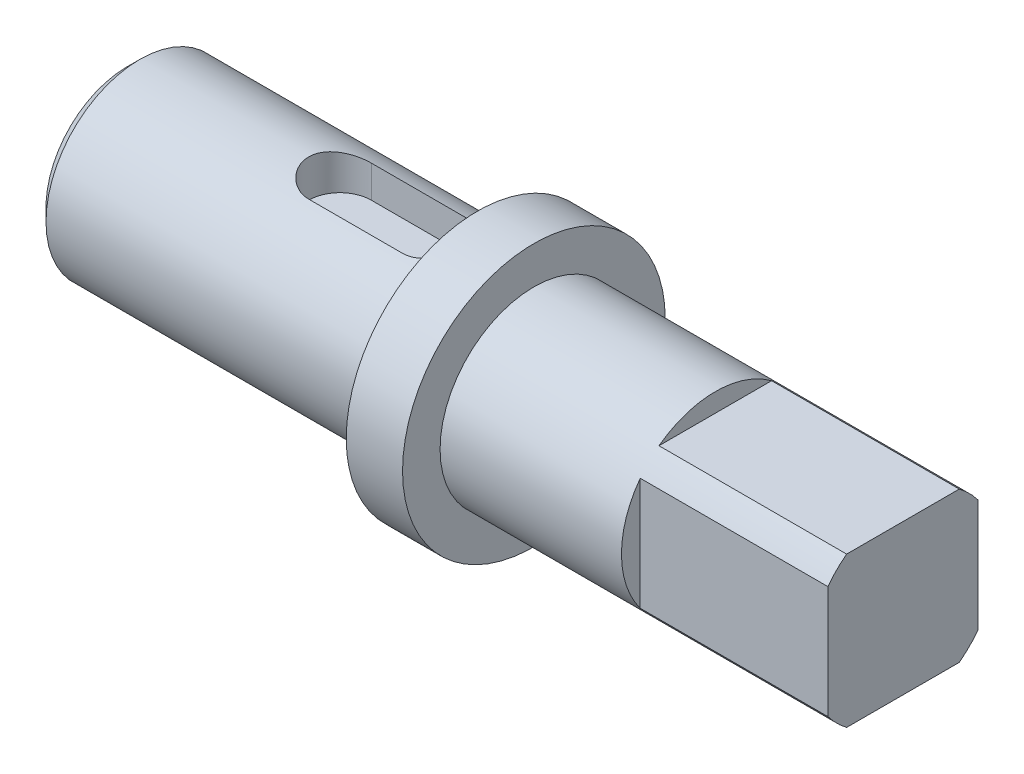
ISO-10303-21;
HEADER;
FILE_DESCRIPTION(('STEP AP214'),'2;1');
FILE_NAME('part.step','',(''),(''),'','','');
FILE_SCHEMA(('AUTOMOTIVE_DESIGN { 1 0 10303 214 1 1 1 1 }'));
ENDSEC;
DATA;
#1=APPLICATION_CONTEXT('core data for automotive mechanical design processes');
#2=APPLICATION_PROTOCOL_DEFINITION('international standard','automotive_design',2000,#1);
#3=PRODUCT_CONTEXT('',#1,'mechanical');
#4=PRODUCT('Part','Part','',(#3));
#5=PRODUCT_RELATED_PRODUCT_CATEGORY('part','',(#4));
#6=PRODUCT_DEFINITION_FORMATION('','',#4);
#7=PRODUCT_DEFINITION_CONTEXT('part definition',#1,'design');
#8=PRODUCT_DEFINITION('design','',#6,#7);
#9=PRODUCT_DEFINITION_SHAPE('','',#8);
#10=(LENGTH_UNIT() NAMED_UNIT(*) SI_UNIT(.MILLI.,.METRE.));
#11=(NAMED_UNIT(*) PLANE_ANGLE_UNIT() SI_UNIT($,.RADIAN.));
#12=(NAMED_UNIT(*) SI_UNIT($,.STERADIAN.) SOLID_ANGLE_UNIT());
#13=UNCERTAINTY_MEASURE_WITH_UNIT(LENGTH_MEASURE(1.E-05),#10,'distance_accuracy_value','');
#14=(GEOMETRIC_REPRESENTATION_CONTEXT(3) GLOBAL_UNCERTAINTY_ASSIGNED_CONTEXT((#13)) GLOBAL_UNIT_ASSIGNED_CONTEXT((#10,
#11,#12)) REPRESENTATION_CONTEXT('',''));
#15=CARTESIAN_POINT('',(0.,0.,0.));
#16=DIRECTION('',(0.,0.,1.));
#17=DIRECTION('',(1.,0.,0.));
#18=AXIS2_PLACEMENT_3D('',#15,#16,#17);
#19=CARTESIAN_POINT('',(0.,0.,0.));
#20=DIRECTION('',(-1.,0.,0.));
#21=DIRECTION('',(0.,0.,1.));
#22=AXIS2_PLACEMENT_3D('',#19,#20,#21);
#23=CYLINDRICAL_SURFACE('',#22,7.5);
#24=CARTESIAN_POINT('',(32.5,0.,0.));
#25=DIRECTION('',(-1.,0.,0.));
#26=DIRECTION('',(0.,0.,1.));
#27=AXIS2_PLACEMENT_3D('',#24,#25,#26);
#28=CIRCLE('',#27,7.5);
#29=CARTESIAN_POINT('',(32.5,0.,7.5));
#30=VERTEX_POINT('',#29);
#31=EDGE_CURVE('E134',#30,#30,#28,.T.);
#32=ORIENTED_EDGE('',*,*,#31,.F.);
#33=EDGE_LOOP('',(#32));
#34=FACE_BOUND('',#33,.T.);
#35=DIRECTION('',(-1.,0.,0.));
#36=VECTOR('',#35,1.);
#37=CARTESIAN_POINT('',(0.,-4.5,-6.));
#38=LINE('',#37,#36);
#39=CARTESIAN_POINT('',(62.,-4.5,-6.));
#40=VERTEX_POINT('',#39);
#41=CARTESIAN_POINT('',(47.,-4.5,-6.));
#42=VERTEX_POINT('',#41);
#43=EDGE_CURVE('E394',#40,#42,#38,.T.);
#44=ORIENTED_EDGE('',*,*,#43,.F.);
#45=CARTESIAN_POINT('',(62.,0.,0.));
#46=DIRECTION('',(-1.,0.,0.));
#47=DIRECTION('',(0.,0.,1.));
#48=AXIS2_PLACEMENT_3D('',#45,#46,#47);
#49=CIRCLE('',#48,7.5);
#50=CARTESIAN_POINT('',(62.,-6.,-4.5));
#51=VERTEX_POINT('',#50);
#52=EDGE_CURVE('E132',#40,#51,#49,.T.);
#53=ORIENTED_EDGE('',*,*,#52,.T.);
#54=DIRECTION('',(-1.,0.,0.));
#55=VECTOR('',#54,1.);
#56=CARTESIAN_POINT('',(0.,-6.,-4.5));
#57=LINE('',#56,#55);
#58=CARTESIAN_POINT('',(47.,-6.,-4.5));
#59=VERTEX_POINT('',#58);
#60=EDGE_CURVE('E39',#59,#51,#57,.F.);
#61=ORIENTED_EDGE('',*,*,#60,.F.);
#62=CARTESIAN_POINT('',(47.,0.,0.));
#63=DIRECTION('',(1.,0.,0.));
#64=DIRECTION('',(0.,0.,-1.));
#65=AXIS2_PLACEMENT_3D('',#62,#63,#64);
#66=CIRCLE('',#65,7.5);
#67=CARTESIAN_POINT('',(47.,-6.,4.5));
#68=VERTEX_POINT('',#67);
#69=EDGE_CURVE('E24',#68,#59,#66,.T.);
#70=ORIENTED_EDGE('',*,*,#69,.F.);
#71=DIRECTION('',(-1.,0.,0.));
#72=VECTOR('',#71,1.);
#73=CARTESIAN_POINT('',(0.,-6.,4.5));
#74=LINE('',#73,#72);
#75=CARTESIAN_POINT('',(62.,-6.,4.5));
#76=VERTEX_POINT('',#75);
#77=EDGE_CURVE('E403',#76,#68,#74,.T.);
#78=ORIENTED_EDGE('',*,*,#77,.F.);
#79=CARTESIAN_POINT('',(62.,-4.5,6.));
#80=VERTEX_POINT('',#79);
#81=EDGE_CURVE('E135',#76,#80,#49,.T.);
#82=ORIENTED_EDGE('',*,*,#81,.T.);
#83=DIRECTION('',(-1.,0.,0.));
#84=VECTOR('',#83,1.);
#85=CARTESIAN_POINT('',(0.,-4.5,6.));
#86=LINE('',#85,#84);
#87=CARTESIAN_POINT('',(47.,-4.5,6.));
#88=VERTEX_POINT('',#87);
#89=EDGE_CURVE('E31',#88,#80,#86,.F.);
#90=ORIENTED_EDGE('',*,*,#89,.F.);
#91=CARTESIAN_POINT('',(47.,4.5,6.));
#92=VERTEX_POINT('',#91);
#93=EDGE_CURVE('E436',#92,#88,#66,.T.);
#94=ORIENTED_EDGE('',*,*,#93,.F.);
#95=DIRECTION('',(-1.,0.,0.));
#96=VECTOR('',#95,1.);
#97=CARTESIAN_POINT('',(0.,4.5,6.));
#98=LINE('',#97,#96);
#99=CARTESIAN_POINT('',(62.,4.5,6.));
#100=VERTEX_POINT('',#99);
#101=EDGE_CURVE('E445',#100,#92,#98,.T.);
#102=ORIENTED_EDGE('',*,*,#101,.F.);
#103=CARTESIAN_POINT('',(62.,6.,4.5));
#104=VERTEX_POINT('',#103);
#105=EDGE_CURVE('E131',#100,#104,#49,.T.);
#106=ORIENTED_EDGE('',*,*,#105,.T.);
#107=DIRECTION('',(-1.,0.,0.));
#108=VECTOR('',#107,1.);
#109=CARTESIAN_POINT('',(0.,6.,4.5));
#110=LINE('',#109,#108);
#111=CARTESIAN_POINT('',(47.,6.,4.5));
#112=VERTEX_POINT('',#111);
#113=EDGE_CURVE('E112',#112,#104,#110,.F.);
#114=ORIENTED_EDGE('',*,*,#113,.F.);
#115=CARTESIAN_POINT('',(47.,6.,-4.5));
#116=VERTEX_POINT('',#115);
#117=EDGE_CURVE('E19',#116,#112,#66,.T.);
#118=ORIENTED_EDGE('',*,*,#117,.F.);
#119=DIRECTION('',(-1.,0.,0.));
#120=VECTOR('',#119,1.);
#121=CARTESIAN_POINT('',(0.,6.,-4.5));
#122=LINE('',#121,#120);
#123=CARTESIAN_POINT('',(62.,6.,-4.5));
#124=VERTEX_POINT('',#123);
#125=EDGE_CURVE('E109',#124,#116,#122,.T.);
#126=ORIENTED_EDGE('',*,*,#125,.F.);
#127=CARTESIAN_POINT('',(62.,4.5,-6.));
#128=VERTEX_POINT('',#127);
#129=EDGE_CURVE('E125',#124,#128,#49,.T.);
#130=ORIENTED_EDGE('',*,*,#129,.T.);
#131=DIRECTION('',(-1.,0.,0.));
#132=VECTOR('',#131,1.);
#133=CARTESIAN_POINT('',(0.,4.5,-6.));
#134=LINE('',#133,#132);
#135=CARTESIAN_POINT('',(47.,4.5,-6.));
#136=VERTEX_POINT('',#135);
#137=EDGE_CURVE('E399',#136,#128,#134,.F.);
#138=ORIENTED_EDGE('',*,*,#137,.F.);
#139=EDGE_CURVE('E10',#42,#136,#66,.T.);
#140=ORIENTED_EDGE('',*,*,#139,.F.);
#141=EDGE_LOOP('',(#44,#53,#61,#70,#78,#82,#90,#94,#102,#106,#114,#118,#126,#130,#138,#140));
#142=FACE_BOUND('',#141,.T.);
#143=ADVANCED_FACE('F15',(#34,#142),#23,.T.);
#144=CARTESIAN_POINT('',(62.,7.5,0.));
#145=DIRECTION('',(-1.,0.,0.));
#146=DIRECTION('',(0.,0.,1.));
#147=AXIS2_PLACEMENT_3D('',#144,#145,#146);
#148=PLANE('',#147);
#149=DIRECTION('',(0.,-1.,0.));
#150=VECTOR('',#149,1.);
#151=CARTESIAN_POINT('',(62.,7.5,-6.));
#152=LINE('',#151,#150);
#153=EDGE_CURVE('E130',#128,#40,#152,.T.);
#154=ORIENTED_EDGE('',*,*,#153,.F.);
#155=ORIENTED_EDGE('',*,*,#129,.F.);
#156=DIRECTION('',(0.,0.,-1.));
#157=VECTOR('',#156,1.);
#158=CARTESIAN_POINT('',(62.,6.,0.));
#159=LINE('',#158,#157);
#160=EDGE_CURVE('E105',#104,#124,#159,.T.);
#161=ORIENTED_EDGE('',*,*,#160,.F.);
#162=ORIENTED_EDGE('',*,*,#105,.F.);
#163=DIRECTION('',(0.,1.,0.));
#164=VECTOR('',#163,1.);
#165=CARTESIAN_POINT('',(62.,7.5,6.));
#166=LINE('',#165,#164);
#167=EDGE_CURVE('E117',#80,#100,#166,.T.);
#168=ORIENTED_EDGE('',*,*,#167,.F.);
#169=ORIENTED_EDGE('',*,*,#81,.F.);
#170=DIRECTION('',(0.,0.,1.));
#171=VECTOR('',#170,1.);
#172=CARTESIAN_POINT('',(62.,-6.,0.));
#173=LINE('',#172,#171);
#174=EDGE_CURVE('E435',#51,#76,#173,.T.);
#175=ORIENTED_EDGE('',*,*,#174,.F.);
#176=ORIENTED_EDGE('',*,*,#52,.F.);
#177=EDGE_LOOP('',(#154,#155,#161,#162,#168,#169,#175,#176));
#178=FACE_BOUND('',#177,.T.);
#179=ADVANCED_FACE('F128',(#178),#148,.F.);
#180=CARTESIAN_POINT('',(0.,0.,0.));
#181=DIRECTION('',(1.,0.,0.));
#182=DIRECTION('',(0.,0.,-1.));
#183=AXIS2_PLACEMENT_3D('',#180,#181,#182);
#184=PLANE('',#183);
#185=CARTESIAN_POINT('',(0.,0.,0.));
#186=DIRECTION('',(1.,0.,0.));
#187=DIRECTION('',(0.,0.,-1.));
#188=AXIS2_PLACEMENT_3D('',#185,#186,#187);
#189=CIRCLE('',#188,6.5);
#190=CARTESIAN_POINT('',(0.,0.,-6.5));
#191=VERTEX_POINT('',#190);
#192=EDGE_CURVE('E152',#191,#191,#189,.F.);
#193=ORIENTED_EDGE('',*,*,#192,.T.);
#194=EDGE_LOOP('',(#193));
#195=FACE_BOUND('',#194,.T.);
#196=ADVANCED_FACE('F196',(#195),#184,.F.);
#197=CARTESIAN_POINT('',(0.,0.,0.));
#198=DIRECTION('',(-1.,0.,0.));
#199=DIRECTION('',(0.,0.,1.));
#200=AXIS2_PLACEMENT_3D('',#197,#198,#199);
#201=CYLINDRICAL_SURFACE('',#200,7.5);
#202=DIRECTION('',(-1.,0.,0.));
#203=VECTOR('',#202,1.);
#204=CARTESIAN_POINT('',(0.,7.07106781186548,-2.5));
#205=LINE('',#204,#203);
#206=CARTESIAN_POINT('',(17.,7.07106781186548,-2.5));
#207=VERTEX_POINT('',#206);
#208=CARTESIAN_POINT('',(24.5,7.07106781186548,-2.5));
#209=VERTEX_POINT('',#208);
#210=EDGE_CURVE('E118',#207,#209,#205,.F.);
#211=ORIENTED_EDGE('',*,*,#210,.T.);
#212=CARTESIAN_POINT('',(24.5,7.07106781186548,-2.5));
#213=CARTESIAN_POINT('',(24.5682070778203,7.07105693273157,-2.50000899110406));
#214=CARTESIAN_POINT('',(24.6364080746754,7.07205443904569,-2.49720887221585));
#215=CARTESIAN_POINT('',(24.7722810383493,7.07598524121007,-2.4860604578047));
#216=CARTESIAN_POINT('',(24.8399531429881,7.07891801450643,-2.47771365997202));
#217=CARTESIAN_POINT('',(24.9740904883546,7.08662705252507,-2.45557459422795));
#218=CARTESIAN_POINT('',(25.0405587025509,7.09139784850119,-2.44179847763135));
#219=CARTESIAN_POINT('',(25.1720082685828,7.10262619906002,-2.4089418103012));
#220=CARTESIAN_POINT('',(25.2369895665899,7.10908381460331,-2.38986106786032));
#221=CARTESIAN_POINT('',(25.4289615797146,7.13069940793911,-2.32491551306196));
#222=CARTESIAN_POINT('',(25.55317915747,7.14811243884051,-2.2713141681025));
#223=CARTESIAN_POINT('',(25.7908768114634,7.1869703408752,-2.14517784106255));
#224=CARTESIAN_POINT('',(25.9043502357802,7.20841768551076,-2.07263123268531));
#225=CARTESIAN_POINT('',(26.1217929034708,7.25386182389478,-1.90762995846818));
#226=CARTESIAN_POINT('',(26.2252851427682,7.27792189428067,-1.81456284630833));
#227=CARTESIAN_POINT('',(26.4155171032337,7.32534626726038,-1.61247071190513));
#228=CARTESIAN_POINT('',(26.502253841319,7.34871044533518,-1.50344285413658));
#229=CARTESIAN_POINT('',(26.6586982242625,7.39284706096344,-1.26900922493972));
#230=CARTESIAN_POINT('',(26.7279023077422,7.41353593532888,-1.14325025284461));
#231=CARTESIAN_POINT('',(26.8439807824347,7.44924021883279,-0.881073095475287));
#232=CARTESIAN_POINT('',(26.8908619949257,7.46425736081205,-0.744658181225885));
#233=CARTESIAN_POINT('',(26.9593392762583,7.48647677762783,-0.470073371182911));
#234=CARTESIAN_POINT('',(26.9817581709572,7.49393272446142,-0.332129588153743));
#235=CARTESIAN_POINT('',(27.0032907567385,7.50109021034827,-0.0542474216361979));
#236=CARTESIAN_POINT('',(27.0024100009158,7.50079359709905,0.0856904786402172));
#237=CARTESIAN_POINT('',(26.9778892895995,7.49265096581776,0.357759612692404));
#238=CARTESIAN_POINT('',(26.9551434043953,7.48510152476446,0.489981756428174));
#239=CARTESIAN_POINT('',(26.8890170040208,7.46367401253772,0.748610161077312));
#240=CARTESIAN_POINT('',(26.8456353446747,7.4497955904479,0.875016099077735));
#241=CARTESIAN_POINT('',(26.7389465758055,7.41689170677793,1.12038155754035));
#242=CARTESIAN_POINT('',(26.6753848871424,7.39780094595656,1.23922126412504));
#243=CARTESIAN_POINT('',(26.530350121575,7.35645969200235,1.46481147275367));
#244=CARTESIAN_POINT('',(26.4488721723979,7.33420833994017,1.57155867428943));
#245=CARTESIAN_POINT('',(26.265822374993,7.28765679856813,1.77524334927518));
#246=CARTESIAN_POINT('',(26.1634861409717,7.26330946699776,1.87148402903098));
#247=CARTESIAN_POINT('',(25.9438962757136,7.21618726182137,2.04568006205173));
#248=CARTESIAN_POINT('',(25.826637843993,7.19341289789386,2.12362950795974));
#249=CARTESIAN_POINT('',(25.5782995541157,7.15175078440791,2.26000831398175));
#250=CARTESIAN_POINT('',(25.4470412126674,7.13292537370586,2.31813252376915));
#251=CARTESIAN_POINT('',(25.1758825560254,7.10202742655098,2.41115057675284));
#252=CARTESIAN_POINT('',(25.0359962665697,7.08994423522482,2.4460810901384));
#253=CARTESIAN_POINT('',(24.82895340813,7.07841355236799,2.47914539070207));
#254=CARTESIAN_POINT('',(24.7633965253644,7.07566669236504,2.48696265313779));
#255=CARTESIAN_POINT('',(24.6319048040005,7.07199258928497,2.49738654017799));
#256=CARTESIAN_POINT('',(24.565970563639,7.0710629982382,2.49999988848745));
#257=CARTESIAN_POINT('',(24.5,7.07106781186548,2.5));
#258=B_SPLINE_CURVE_WITH_KNOTS('',3,(#212,#213,#214,#215,#216,#217,#218,#219,#220,#221,#222,
#223,#224,#225,#226,#227,#228,#229,#230,#231,#232,#233,#234,#235,#236,#237,#238,#239,#240,#241,
#242,#243,#244,#245,#246,#247,#248,#249,#250,#251,#252,#253,#254,#255,#256,#257),.UNSPECIFIED.,
.F.,.F.,(4,2,2,2,2,2,2,2,2,2,2,2,2,2,2,2,2,2,2,2,2,2,4),(0.,0.204546211838591,0.40903721542367,
0.612924429429088,0.816819012805401,1.22401016923254,1.63145179965521,2.05327864088389,
2.47518051341065,2.90809434014449,3.34087579484514,3.75860278500203,4.17623021758302,
4.57747647846034,4.97874498952316,5.38529148746616,5.79194868153618,6.21771736826822,
6.64362337304801,7.07581676501794,7.50732520398792,7.70536340013574,7.90314555504337),.UNSPECIFIED.);
#259=CARTESIAN_POINT('',(24.5,7.07106781186548,2.5));
#260=VERTEX_POINT('',#259);
#261=EDGE_CURVE('E158',#209,#260,#258,.T.);
#262=ORIENTED_EDGE('',*,*,#261,.T.);
#263=DIRECTION('',(-1.,0.,0.));
#264=VECTOR('',#263,1.);
#265=CARTESIAN_POINT('',(0.,7.07106781186548,2.5));
#266=LINE('',#265,#264);
#267=CARTESIAN_POINT('',(17.,7.07106781186548,2.5));
#268=VERTEX_POINT('',#267);
#269=EDGE_CURVE('E430',#260,#268,#266,.T.);
#270=ORIENTED_EDGE('',*,*,#269,.T.);
#271=CARTESIAN_POINT('',(17.,7.07106781186548,2.5));
#272=CARTESIAN_POINT('',(16.9317929221797,7.07105693273157,2.50000899110406));
#273=CARTESIAN_POINT('',(16.8635919253246,7.07205443904569,2.49720887221585));
#274=CARTESIAN_POINT('',(16.7277189616507,7.07598524121007,2.4860604578047));
#275=CARTESIAN_POINT('',(16.6600468570119,7.07891801450642,2.47771365997202));
#276=CARTESIAN_POINT('',(16.5259095116454,7.08662705252507,2.45557459422795));
#277=CARTESIAN_POINT('',(16.4594412974491,7.09139784850119,2.44179847763135));
#278=CARTESIAN_POINT('',(16.3279917314172,7.10262619906002,2.4089418103012));
#279=CARTESIAN_POINT('',(16.2630104334101,7.10908381460331,2.38986106786032));
#280=CARTESIAN_POINT('',(16.0710384202854,7.13069940793911,2.32491551306196));
#281=CARTESIAN_POINT('',(15.94682084253,7.14811243884051,2.2713141681025));
#282=CARTESIAN_POINT('',(15.7091231885366,7.1869703408752,2.14517784106255));
#283=CARTESIAN_POINT('',(15.5956497642198,7.20841768551076,2.07263123268531));
#284=CARTESIAN_POINT('',(15.3782070965292,7.25386182389478,1.90762995846818));
#285=CARTESIAN_POINT('',(15.2747148572318,7.27792189428067,1.81456284630833));
#286=CARTESIAN_POINT('',(15.0844828967663,7.32534626726038,1.61247071190512));
#287=CARTESIAN_POINT('',(14.997746158681,7.34871044533518,1.50344285413658));
#288=CARTESIAN_POINT('',(14.8413017757375,7.39284706096344,1.26900922493972));
#289=CARTESIAN_POINT('',(14.7720976922578,7.41353593532888,1.14325025284461));
#290=CARTESIAN_POINT('',(14.6560192175653,7.44924021883279,0.881073095475287));
#291=CARTESIAN_POINT('',(14.6091380050743,7.46425736081205,0.744658181225883));
#292=CARTESIAN_POINT('',(14.5406607237417,7.48647677762783,0.470073371182909));
#293=CARTESIAN_POINT('',(14.5182418290428,7.49393272446142,0.332129588153743));
#294=CARTESIAN_POINT('',(14.4967092432615,7.50109021034827,0.0542474216361983));
#295=CARTESIAN_POINT('',(14.4975899990842,7.50079359709905,-0.0856904786402172));
#296=CARTESIAN_POINT('',(14.5221107104005,7.49265096581776,-0.357759612692404));
#297=CARTESIAN_POINT('',(14.5448565956047,7.48510152476446,-0.489981756428173));
#298=CARTESIAN_POINT('',(14.6109829959792,7.46367401253772,-0.748610161077312));
#299=CARTESIAN_POINT('',(14.6543646553253,7.4497955904479,-0.875016099077737));
#300=CARTESIAN_POINT('',(14.7610534241945,7.41689170677793,-1.12038155754035));
#301=CARTESIAN_POINT('',(14.8246151128576,7.39780094595656,-1.23922126412504));
#302=CARTESIAN_POINT('',(14.969649878425,7.35645969200235,-1.46481147275367));
#303=CARTESIAN_POINT('',(15.0511278276021,7.33420833994017,-1.57155867428943));
#304=CARTESIAN_POINT('',(15.234177625007,7.28765679856813,-1.77524334927518));
#305=CARTESIAN_POINT('',(15.3365138590283,7.26330946699776,-1.87148402903098));
#306=CARTESIAN_POINT('',(15.5561037242864,7.21618726182137,-2.04568006205173));
#307=CARTESIAN_POINT('',(15.673362156007,7.19341289789386,-2.12362950795974));
#308=CARTESIAN_POINT('',(15.9217004458843,7.15175078440791,-2.26000831398175));
#309=CARTESIAN_POINT('',(16.0529587873326,7.13292537370586,-2.31813252376915));
#310=CARTESIAN_POINT('',(16.3241174439746,7.10202742655098,-2.41115057675284));
#311=CARTESIAN_POINT('',(16.4640037334303,7.08994423522482,-2.4460810901384));
#312=CARTESIAN_POINT('',(16.67104659187,7.07841355236799,-2.47914539070207));
#313=CARTESIAN_POINT('',(16.7366034746356,7.07566669236504,-2.48696265313779));
#314=CARTESIAN_POINT('',(16.8680951959995,7.07199258928497,-2.49738654017799));
#315=CARTESIAN_POINT('',(16.934029436361,7.0710629982382,-2.49999988848745));
#316=CARTESIAN_POINT('',(17.,7.07106781186548,-2.5));
#317=B_SPLINE_CURVE_WITH_KNOTS('',3,(#271,#272,#273,#274,#275,#276,#277,#278,#279,#280,#281,
#282,#283,#284,#285,#286,#287,#288,#289,#290,#291,#292,#293,#294,#295,#296,#297,#298,#299,#300,
#301,#302,#303,#304,#305,#306,#307,#308,#309,#310,#311,#312,#313,#314,#315,#316),.UNSPECIFIED.,
.F.,.F.,(4,2,2,2,2,2,2,2,2,2,2,2,2,2,2,2,2,2,2,2,2,2,4),(0.,0.204546211838587,0.409037215423666,
0.612924429429085,0.816819012805401,1.22401016923254,1.63145179965521,2.05327864088389,
2.47518051341064,2.90809434014449,3.34087579484514,3.75860278500203,4.17623021758301,
4.57747647846033,4.97874498952315,5.38529148746615,5.79194868153618,6.21771736826821,
6.643623373048,7.07581676501793,7.50732520398792,7.70536340013574,7.90314555504337),.UNSPECIFIED.);
#318=EDGE_CURVE('E167',#268,#207,#317,.T.);
#319=ORIENTED_EDGE('',*,*,#318,.T.);
#320=EDGE_LOOP('',(#211,#262,#270,#319));
#321=FACE_BOUND('',#320,.T.);
#322=CARTESIAN_POINT('',(1.00000000000001,0.,0.));
#323=DIRECTION('',(1.,0.,0.));
#324=DIRECTION('',(0.,0.,-1.));
#325=AXIS2_PLACEMENT_3D('',#322,#323,#324);
#326=CIRCLE('',#325,7.5);
#327=CARTESIAN_POINT('',(1.00000000000001,0.,-7.5));
#328=VERTEX_POINT('',#327);
#329=EDGE_CURVE('E155',#328,#328,#326,.T.);
#330=ORIENTED_EDGE('',*,*,#329,.T.);
#331=EDGE_LOOP('',(#330));
#332=FACE_BOUND('',#331,.T.);
#333=CARTESIAN_POINT('',(28.,0.,0.));
#334=DIRECTION('',(-1.,0.,0.));
#335=DIRECTION('',(0.,0.,1.));
#336=AXIS2_PLACEMENT_3D('',#333,#334,#335);
#337=CIRCLE('',#336,7.5);
#338=CARTESIAN_POINT('',(28.,0.,7.5));
#339=VERTEX_POINT('',#338);
#340=EDGE_CURVE('E149',#339,#339,#337,.T.);
#341=ORIENTED_EDGE('',*,*,#340,.T.);
#342=EDGE_LOOP('',(#341));
#343=FACE_BOUND('',#342,.T.);
#344=ADVANCED_FACE('F174',(#321,#332,#343),#201,.T.);
#345=CARTESIAN_POINT('',(28.,7.5,0.));
#346=DIRECTION('',(1.,0.,0.));
#347=DIRECTION('',(0.,0.,-1.));
#348=AXIS2_PLACEMENT_3D('',#345,#346,#347);
#349=PLANE('',#348);
#350=ORIENTED_EDGE('',*,*,#340,.F.);
#351=EDGE_LOOP('',(#350));
#352=FACE_BOUND('',#351,.T.);
#353=CARTESIAN_POINT('',(28.,0.,0.));
#354=DIRECTION('',(-1.,0.,0.));
#355=DIRECTION('',(0.,0.,1.));
#356=AXIS2_PLACEMENT_3D('',#353,#354,#355);
#357=CIRCLE('',#356,10.5);
#358=CARTESIAN_POINT('',(28.,0.,10.5));
#359=VERTEX_POINT('',#358);
#360=EDGE_CURVE('E146',#359,#359,#357,.T.);
#361=ORIENTED_EDGE('',*,*,#360,.T.);
#362=EDGE_LOOP('',(#361));
#363=FACE_BOUND('',#362,.T.);
#364=ADVANCED_FACE('F206',(#352,#363),#349,.F.);
#365=CARTESIAN_POINT('',(0.,0.,0.));
#366=DIRECTION('',(-1.,0.,0.));
#367=DIRECTION('',(0.,0.,1.));
#368=AXIS2_PLACEMENT_3D('',#365,#366,#367);
#369=CYLINDRICAL_SURFACE('',#368,10.5);
#370=ORIENTED_EDGE('',*,*,#360,.F.);
#371=EDGE_LOOP('',(#370));
#372=FACE_BOUND('',#371,.T.);
#373=CARTESIAN_POINT('',(32.5,0.,0.));
#374=DIRECTION('',(-1.,0.,0.));
#375=DIRECTION('',(0.,0.,1.));
#376=AXIS2_PLACEMENT_3D('',#373,#374,#375);
#377=CIRCLE('',#376,10.5);
#378=CARTESIAN_POINT('',(32.5,0.,10.5));
#379=VERTEX_POINT('',#378);
#380=EDGE_CURVE('E143',#379,#379,#377,.T.);
#381=ORIENTED_EDGE('',*,*,#380,.T.);
#382=EDGE_LOOP('',(#381));
#383=FACE_BOUND('',#382,.T.);
#384=ADVANCED_FACE('F203',(#372,#383),#369,.T.);
#385=CARTESIAN_POINT('',(32.5,10.5,0.));
#386=DIRECTION('',(-1.,0.,0.));
#387=DIRECTION('',(0.,0.,1.));
#388=AXIS2_PLACEMENT_3D('',#385,#386,#387);
#389=PLANE('',#388);
#390=ORIENTED_EDGE('',*,*,#380,.F.);
#391=EDGE_LOOP('',(#390));
#392=FACE_BOUND('',#391,.T.);
#393=ORIENTED_EDGE('',*,*,#31,.T.);
#394=EDGE_LOOP('',(#393));
#395=FACE_BOUND('',#394,.T.);
#396=ADVANCED_FACE('F200',(#392,#395),#389,.F.);
#397=CARTESIAN_POINT('',(0.,0.,0.));
#398=DIRECTION('',(1.,0.,0.));
#399=DIRECTION('',(0.,0.,-1.));
#400=AXIS2_PLACEMENT_3D('',#397,#398,#399);
#401=CONICAL_SURFACE('',#400,6.5,0.785398163397446);
#402=ORIENTED_EDGE('',*,*,#329,.F.);
#403=EDGE_LOOP('',(#402));
#404=FACE_BOUND('',#403,.T.);
#405=ORIENTED_EDGE('',*,*,#192,.F.);
#406=EDGE_LOOP('',(#405));
#407=FACE_BOUND('',#406,.T.);
#408=ADVANCED_FACE('F17',(#404,#407),#401,.T.);
#409=CARTESIAN_POINT('',(17.,4.5,0.));
#410=DIRECTION('',(0.,1.,0.));
#411=DIRECTION('',(0.,0.,1.));
#412=AXIS2_PLACEMENT_3D('',#409,#410,#411);
#413=CYLINDRICAL_SURFACE('',#412,2.5);
#414=DIRECTION('',(0.,1.,0.));
#415=VECTOR('',#414,1.);
#416=CARTESIAN_POINT('',(17.,4.5,2.5));
#417=LINE('',#416,#415);
#418=CARTESIAN_POINT('',(17.,4.5,2.5));
#419=VERTEX_POINT('',#418);
#420=EDGE_CURVE('E139',#419,#268,#417,.T.);
#421=ORIENTED_EDGE('',*,*,#420,.F.);
#422=CARTESIAN_POINT('',(17.,4.5,0.));
#423=DIRECTION('',(0.,1.,0.));
#424=DIRECTION('',(0.,0.,1.));
#425=AXIS2_PLACEMENT_3D('',#422,#423,#424);
#426=CIRCLE('',#425,2.5);
#427=CARTESIAN_POINT('',(17.,4.5,-2.5));
#428=VERTEX_POINT('',#427);
#429=EDGE_CURVE('E398',#428,#419,#426,.T.);
#430=ORIENTED_EDGE('',*,*,#429,.F.);
#431=DIRECTION('',(0.,1.,0.));
#432=VECTOR('',#431,1.);
#433=CARTESIAN_POINT('',(17.,4.5,-2.5));
#434=LINE('',#433,#432);
#435=EDGE_CURVE('E419',#428,#207,#434,.T.);
#436=ORIENTED_EDGE('',*,*,#435,.T.);
#437=ORIENTED_EDGE('',*,*,#318,.F.);
#438=EDGE_LOOP('',(#421,#430,#436,#437));
#439=FACE_BOUND('',#438,.T.);
#440=ADVANCED_FACE('F189',(#439),#413,.F.);
#441=CARTESIAN_POINT('',(17.,4.5,-2.5));
#442=DIRECTION('',(0.,0.,-1.));
#443=DIRECTION('',(-1.,0.,0.));
#444=AXIS2_PLACEMENT_3D('',#441,#442,#443);
#445=PLANE('',#444);
#446=ORIENTED_EDGE('',*,*,#435,.F.);
#447=DIRECTION('',(-1.,0.,0.));
#448=VECTOR('',#447,1.);
#449=CARTESIAN_POINT('',(17.,4.5,-2.5));
#450=LINE('',#449,#448);
#451=CARTESIAN_POINT('',(24.5,4.5,-2.5));
#452=VERTEX_POINT('',#451);
#453=EDGE_CURVE('E416',#452,#428,#450,.T.);
#454=ORIENTED_EDGE('',*,*,#453,.F.);
#455=DIRECTION('',(0.,1.,0.));
#456=VECTOR('',#455,1.);
#457=CARTESIAN_POINT('',(24.5,4.5,-2.5));
#458=LINE('',#457,#456);
#459=EDGE_CURVE('E422',#452,#209,#458,.T.);
#460=ORIENTED_EDGE('',*,*,#459,.T.);
#461=ORIENTED_EDGE('',*,*,#210,.F.);
#462=EDGE_LOOP('',(#446,#454,#460,#461));
#463=FACE_BOUND('',#462,.T.);
#464=ADVANCED_FACE('F183',(#463),#445,.F.);
#465=CARTESIAN_POINT('',(24.5,4.5,0.));
#466=DIRECTION('',(0.,1.,0.));
#467=DIRECTION('',(0.,0.,1.));
#468=AXIS2_PLACEMENT_3D('',#465,#466,#467);
#469=CYLINDRICAL_SURFACE('',#468,2.5);
#470=ORIENTED_EDGE('',*,*,#459,.F.);
#471=CARTESIAN_POINT('',(24.5,4.5,0.));
#472=DIRECTION('',(0.,1.,0.));
#473=DIRECTION('',(0.,0.,1.));
#474=AXIS2_PLACEMENT_3D('',#471,#472,#473);
#475=CIRCLE('',#474,2.5);
#476=CARTESIAN_POINT('',(24.5,4.5,2.5));
#477=VERTEX_POINT('',#476);
#478=EDGE_CURVE('E413',#477,#452,#475,.T.);
#479=ORIENTED_EDGE('',*,*,#478,.F.);
#480=DIRECTION('',(0.,1.,0.));
#481=VECTOR('',#480,1.);
#482=CARTESIAN_POINT('',(24.5,4.5,2.5));
#483=LINE('',#482,#481);
#484=EDGE_CURVE('E424',#477,#260,#483,.T.);
#485=ORIENTED_EDGE('',*,*,#484,.T.);
#486=ORIENTED_EDGE('',*,*,#261,.F.);
#487=EDGE_LOOP('',(#470,#479,#485,#486));
#488=FACE_BOUND('',#487,.T.);
#489=ADVANCED_FACE('F177',(#488),#469,.F.);
#490=CARTESIAN_POINT('',(17.,4.5,2.5));
#491=DIRECTION('',(0.,0.,1.));
#492=DIRECTION('',(1.,0.,0.));
#493=AXIS2_PLACEMENT_3D('',#490,#491,#492);
#494=PLANE('',#493);
#495=ORIENTED_EDGE('',*,*,#484,.F.);
#496=DIRECTION('',(1.,0.,0.));
#497=VECTOR('',#496,1.);
#498=CARTESIAN_POINT('',(17.,4.5,2.5));
#499=LINE('',#498,#497);
#500=EDGE_CURVE('E410',#419,#477,#499,.T.);
#501=ORIENTED_EDGE('',*,*,#500,.F.);
#502=ORIENTED_EDGE('',*,*,#420,.T.);
#503=ORIENTED_EDGE('',*,*,#269,.F.);
#504=EDGE_LOOP('',(#495,#501,#502,#503));
#505=FACE_BOUND('',#504,.T.);
#506=ADVANCED_FACE('F182',(#505),#494,.F.);
#507=CARTESIAN_POINT('',(17.,4.5,0.));
#508=DIRECTION('',(0.,1.,0.));
#509=DIRECTION('',(0.,0.,1.));
#510=AXIS2_PLACEMENT_3D('',#507,#508,#509);
#511=PLANE('',#510);
#512=ORIENTED_EDGE('',*,*,#429,.T.);
#513=ORIENTED_EDGE('',*,*,#500,.T.);
#514=ORIENTED_EDGE('',*,*,#478,.T.);
#515=ORIENTED_EDGE('',*,*,#453,.T.);
#516=EDGE_LOOP('',(#512,#513,#514,#515));
#517=FACE_BOUND('',#516,.T.);
#518=ADVANCED_FACE('F187',(#517),#511,.T.);
#519=CARTESIAN_POINT('',(47.,6.,6.));
#520=DIRECTION('',(0.,1.,0.));
#521=DIRECTION('',(0.,0.,1.));
#522=AXIS2_PLACEMENT_3D('',#519,#520,#521);
#523=PLANE('',#522);
#524=ORIENTED_EDGE('',*,*,#125,.T.);
#525=DIRECTION('',(0.,0.,1.));
#526=VECTOR('',#525,1.);
#527=CARTESIAN_POINT('',(47.,6.,6.));
#528=LINE('',#527,#526);
#529=EDGE_CURVE('E401',#116,#112,#528,.T.);
#530=ORIENTED_EDGE('',*,*,#529,.T.);
#531=ORIENTED_EDGE('',*,*,#113,.T.);
#532=ORIENTED_EDGE('',*,*,#160,.T.);
#533=EDGE_LOOP('',(#524,#530,#531,#532));
#534=FACE_BOUND('',#533,.T.);
#535=ADVANCED_FACE('F107',(#534),#523,.T.);
#536=CARTESIAN_POINT('',(47.,0.,0.));
#537=DIRECTION('',(1.,0.,0.));
#538=DIRECTION('',(0.,0.,-1.));
#539=AXIS2_PLACEMENT_3D('',#536,#537,#538);
#540=PLANE('',#539);
#541=ORIENTED_EDGE('',*,*,#117,.T.);
#542=ORIENTED_EDGE('',*,*,#529,.F.);
#543=EDGE_LOOP('',(#541,#542));
#544=FACE_BOUND('',#543,.T.);
#545=ADVANCED_FACE('F284',(#544),#540,.T.);
#546=CARTESIAN_POINT('',(47.,-6.,6.));
#547=DIRECTION('',(0.,0.,1.));
#548=DIRECTION('',(1.,0.,0.));
#549=AXIS2_PLACEMENT_3D('',#546,#547,#548);
#550=PLANE('',#549);
#551=ORIENTED_EDGE('',*,*,#101,.T.);
#552=DIRECTION('',(0.,-1.,0.));
#553=VECTOR('',#552,1.);
#554=CARTESIAN_POINT('',(47.,-6.,6.));
#555=LINE('',#554,#553);
#556=EDGE_CURVE('E443',#92,#88,#555,.T.);
#557=ORIENTED_EDGE('',*,*,#556,.T.);
#558=ORIENTED_EDGE('',*,*,#89,.T.);
#559=ORIENTED_EDGE('',*,*,#167,.T.);
#560=EDGE_LOOP('',(#551,#557,#558,#559));
#561=FACE_BOUND('',#560,.T.);
#562=ADVANCED_FACE('F292',(#561),#550,.T.);
#563=ORIENTED_EDGE('',*,*,#93,.T.);
#564=ORIENTED_EDGE('',*,*,#556,.F.);
#565=EDGE_LOOP('',(#563,#564));
#566=FACE_BOUND('',#565,.T.);
#567=ADVANCED_FACE('F295',(#566),#540,.T.);
#568=CARTESIAN_POINT('',(47.,-6.,6.));
#569=DIRECTION('',(0.,-1.,0.));
#570=DIRECTION('',(0.,0.,-1.));
#571=AXIS2_PLACEMENT_3D('',#568,#569,#570);
#572=PLANE('',#571);
#573=ORIENTED_EDGE('',*,*,#77,.T.);
#574=DIRECTION('',(0.,0.,-1.));
#575=VECTOR('',#574,1.);
#576=CARTESIAN_POINT('',(47.,-6.,6.));
#577=LINE('',#576,#575);
#578=EDGE_CURVE('E441',#68,#59,#577,.T.);
#579=ORIENTED_EDGE('',*,*,#578,.T.);
#580=ORIENTED_EDGE('',*,*,#60,.T.);
#581=ORIENTED_EDGE('',*,*,#174,.T.);
#582=EDGE_LOOP('',(#573,#579,#580,#581));
#583=FACE_BOUND('',#582,.T.);
#584=ADVANCED_FACE('F310',(#583),#572,.T.);
#585=ORIENTED_EDGE('',*,*,#69,.T.);
#586=ORIENTED_EDGE('',*,*,#578,.F.);
#587=EDGE_LOOP('',(#585,#586));
#588=FACE_BOUND('',#587,.T.);
#589=ADVANCED_FACE('F312',(#588),#540,.T.);
#590=ORIENTED_EDGE('',*,*,#139,.T.);
#591=DIRECTION('',(0.,1.,0.));
#592=VECTOR('',#591,1.);
#593=CARTESIAN_POINT('',(47.,-6.,-6.));
#594=LINE('',#593,#592);
#595=EDGE_CURVE('E396',#42,#136,#594,.T.);
#596=ORIENTED_EDGE('',*,*,#595,.F.);
#597=EDGE_LOOP('',(#590,#596));
#598=FACE_BOUND('',#597,.T.);
#599=ADVANCED_FACE('F296',(#598),#540,.T.);
#600=CARTESIAN_POINT('',(47.,-6.,-6.));
#601=DIRECTION('',(0.,0.,-1.));
#602=DIRECTION('',(-1.,0.,0.));
#603=AXIS2_PLACEMENT_3D('',#600,#601,#602);
#604=PLANE('',#603);
#605=ORIENTED_EDGE('',*,*,#43,.T.);
#606=ORIENTED_EDGE('',*,*,#595,.T.);
#607=ORIENTED_EDGE('',*,*,#137,.T.);
#608=ORIENTED_EDGE('',*,*,#153,.T.);
#609=EDGE_LOOP('',(#605,#606,#607,#608));
#610=FACE_BOUND('',#609,.T.);
#611=ADVANCED_FACE('F333',(#610),#604,.T.);
#612=CLOSED_SHELL('',(#143,#179,#196,#344,#364,#384,#396,#408,#440,#464,#489,#506,#518,#535,
#545,#562,#567,#584,#589,#599,#611));
#613=MANIFOLD_SOLID_BREP('B1',#612);
#614=ADVANCED_BREP_SHAPE_REPRESENTATION('',(#18,#613),#14);
#615=SHAPE_DEFINITION_REPRESENTATION(#9,#614);
ENDSEC;
END-ISO-10303-21;
